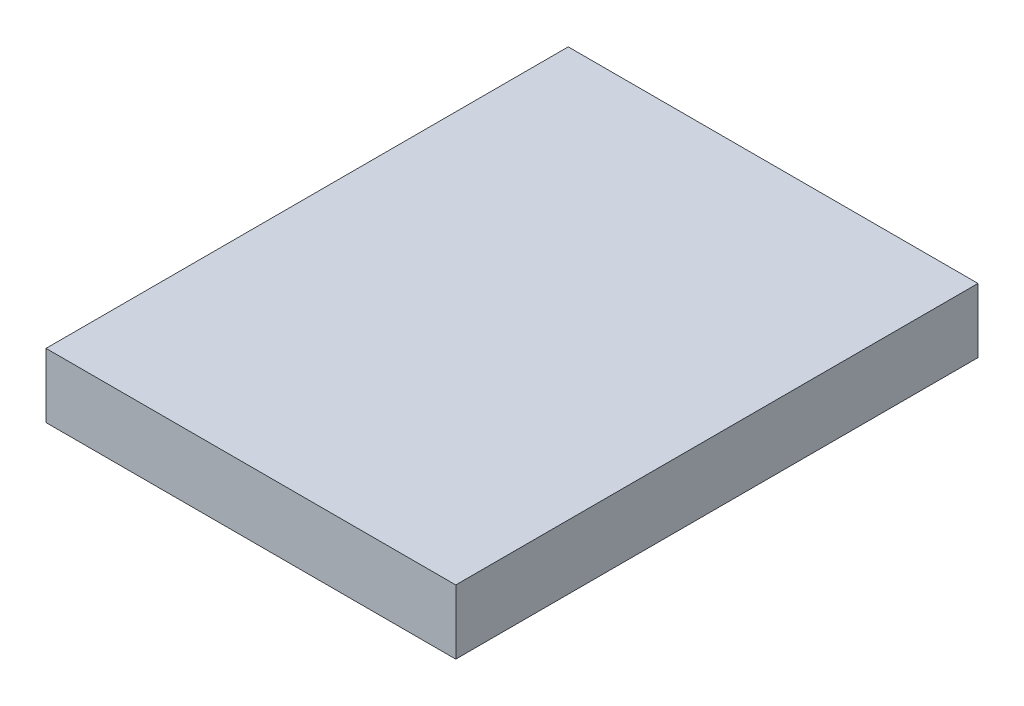
ISO-10303-21;
HEADER;
FILE_DESCRIPTION(('STEP AP214'),'2;1');
FILE_NAME('part.step','',(''),(''),'','','');
FILE_SCHEMA(('AUTOMOTIVE_DESIGN { 1 0 10303 214 1 1 1 1 }'));
ENDSEC;
DATA;
#1=APPLICATION_CONTEXT('core data for automotive mechanical design processes');
#2=APPLICATION_PROTOCOL_DEFINITION('international standard','automotive_design',2000,#1);
#3=PRODUCT_CONTEXT('',#1,'mechanical');
#4=PRODUCT('Part','Part','',(#3));
#5=PRODUCT_RELATED_PRODUCT_CATEGORY('part','',(#4));
#6=PRODUCT_DEFINITION_FORMATION('','',#4);
#7=PRODUCT_DEFINITION_CONTEXT('part definition',#1,'design');
#8=PRODUCT_DEFINITION('design','',#6,#7);
#9=PRODUCT_DEFINITION_SHAPE('','',#8);
#10=(LENGTH_UNIT() NAMED_UNIT(*) SI_UNIT(.MILLI.,.METRE.));
#11=(NAMED_UNIT(*) PLANE_ANGLE_UNIT() SI_UNIT($,.RADIAN.));
#12=(NAMED_UNIT(*) SI_UNIT($,.STERADIAN.) SOLID_ANGLE_UNIT());
#13=UNCERTAINTY_MEASURE_WITH_UNIT(LENGTH_MEASURE(1.E-05),#10,'distance_accuracy_value','');
#14=(GEOMETRIC_REPRESENTATION_CONTEXT(3) GLOBAL_UNCERTAINTY_ASSIGNED_CONTEXT((#13)) GLOBAL_UNIT_ASSIGNED_CONTEXT((#10,
#11,#12)) REPRESENTATION_CONTEXT('',''));
#15=CARTESIAN_POINT('',(0.,0.,0.));
#16=DIRECTION('',(0.,0.,1.));
#17=DIRECTION('',(1.,0.,0.));
#18=AXIS2_PLACEMENT_3D('',#15,#16,#17);
#19=CARTESIAN_POINT('',(25.5,8.,32.5));
#20=DIRECTION('',(-1.,0.,0.));
#21=DIRECTION('',(0.,0.,1.));
#22=AXIS2_PLACEMENT_3D('',#19,#20,#21);
#23=PLANE('',#22);
#24=DIRECTION('',(0.,0.,-1.));
#25=VECTOR('',#24,1.);
#26=CARTESIAN_POINT('',(25.5,0.,32.5));
#27=LINE('',#26,#25);
#28=CARTESIAN_POINT('',(25.5,0.,32.5));
#29=VERTEX_POINT('',#28);
#30=CARTESIAN_POINT('',(25.5,0.,-32.5));
#31=VERTEX_POINT('',#30);
#32=EDGE_CURVE('E98',#29,#31,#27,.T.);
#33=ORIENTED_EDGE('',*,*,#32,.T.);
#34=DIRECTION('',(0.,-1.,0.));
#35=VECTOR('',#34,1.);
#36=CARTESIAN_POINT('',(25.5,8.,-32.5));
#37=LINE('',#36,#35);
#38=CARTESIAN_POINT('',(25.5,8.,-32.5));
#39=VERTEX_POINT('',#38);
#40=EDGE_CURVE('E11',#39,#31,#37,.T.);
#41=ORIENTED_EDGE('',*,*,#40,.F.);
#42=DIRECTION('',(0.,0.,-1.));
#43=VECTOR('',#42,1.);
#44=CARTESIAN_POINT('',(25.5,8.,32.5));
#45=LINE('',#44,#43);
#46=CARTESIAN_POINT('',(25.5,8.,32.5));
#47=VERTEX_POINT('',#46);
#48=EDGE_CURVE('E86',#47,#39,#45,.T.);
#49=ORIENTED_EDGE('',*,*,#48,.F.);
#50=DIRECTION('',(0.,-1.,0.));
#51=VECTOR('',#50,1.);
#52=CARTESIAN_POINT('',(25.5,8.,32.5));
#53=LINE('',#52,#51);
#54=EDGE_CURVE('E94',#47,#29,#53,.T.);
#55=ORIENTED_EDGE('',*,*,#54,.T.);
#56=EDGE_LOOP('',(#33,#41,#49,#55));
#57=FACE_BOUND('',#56,.T.);
#58=ADVANCED_FACE('F35',(#57),#23,.F.);
#59=CARTESIAN_POINT('',(-25.5,8.,-32.5));
#60=DIRECTION('',(0.,0.,1.));
#61=DIRECTION('',(1.,0.,0.));
#62=AXIS2_PLACEMENT_3D('',#59,#60,#61);
#63=PLANE('',#62);
#64=DIRECTION('',(-1.,0.,0.));
#65=VECTOR('',#64,1.);
#66=CARTESIAN_POINT('',(-25.5,0.,-32.5));
#67=LINE('',#66,#65);
#68=CARTESIAN_POINT('',(-25.5,0.,-32.5));
#69=VERTEX_POINT('',#68);
#70=EDGE_CURVE('E90',#31,#69,#67,.T.);
#71=ORIENTED_EDGE('',*,*,#70,.T.);
#72=DIRECTION('',(0.,-1.,0.));
#73=VECTOR('',#72,1.);
#74=CARTESIAN_POINT('',(-25.5,8.,-32.5));
#75=LINE('',#74,#73);
#76=CARTESIAN_POINT('',(-25.5,8.,-32.5));
#77=VERTEX_POINT('',#76);
#78=EDGE_CURVE('E43',#77,#69,#75,.T.);
#79=ORIENTED_EDGE('',*,*,#78,.F.);
#80=DIRECTION('',(-1.,0.,0.));
#81=VECTOR('',#80,1.);
#82=CARTESIAN_POINT('',(-25.5,8.,-32.5));
#83=LINE('',#82,#81);
#84=EDGE_CURVE('E81',#39,#77,#83,.T.);
#85=ORIENTED_EDGE('',*,*,#84,.F.);
#86=ORIENTED_EDGE('',*,*,#40,.T.);
#87=EDGE_LOOP('',(#71,#79,#85,#86));
#88=FACE_BOUND('',#87,.T.);
#89=ADVANCED_FACE('F89',(#88),#63,.F.);
#90=CARTESIAN_POINT('',(-25.5,8.,32.5));
#91=DIRECTION('',(1.,0.,0.));
#92=DIRECTION('',(0.,0.,-1.));
#93=AXIS2_PLACEMENT_3D('',#90,#91,#92);
#94=PLANE('',#93);
#95=DIRECTION('',(0.,0.,1.));
#96=VECTOR('',#95,1.);
#97=CARTESIAN_POINT('',(-25.5,0.,32.5));
#98=LINE('',#97,#96);
#99=CARTESIAN_POINT('',(-25.5,0.,32.5));
#100=VERTEX_POINT('',#99);
#101=EDGE_CURVE('E68',#69,#100,#98,.T.);
#102=ORIENTED_EDGE('',*,*,#101,.T.);
#103=DIRECTION('',(0.,-1.,0.));
#104=VECTOR('',#103,1.);
#105=CARTESIAN_POINT('',(-25.5,8.,32.5));
#106=LINE('',#105,#104);
#107=CARTESIAN_POINT('',(-25.5,8.,32.5));
#108=VERTEX_POINT('',#107);
#109=EDGE_CURVE('E91',#108,#100,#106,.T.);
#110=ORIENTED_EDGE('',*,*,#109,.F.);
#111=DIRECTION('',(0.,0.,1.));
#112=VECTOR('',#111,1.);
#113=CARTESIAN_POINT('',(-25.5,8.,32.5));
#114=LINE('',#113,#112);
#115=EDGE_CURVE('E84',#77,#108,#114,.T.);
#116=ORIENTED_EDGE('',*,*,#115,.F.);
#117=ORIENTED_EDGE('',*,*,#78,.T.);
#118=EDGE_LOOP('',(#102,#110,#116,#117));
#119=FACE_BOUND('',#118,.T.);
#120=ADVANCED_FACE('F92',(#119),#94,.F.);
#121=CARTESIAN_POINT('',(-25.5,8.,32.5));
#122=DIRECTION('',(0.,0.,-1.));
#123=DIRECTION('',(-1.,0.,0.));
#124=AXIS2_PLACEMENT_3D('',#121,#122,#123);
#125=PLANE('',#124);
#126=DIRECTION('',(1.,0.,0.));
#127=VECTOR('',#126,1.);
#128=CARTESIAN_POINT('',(-25.5,0.,32.5));
#129=LINE('',#128,#127);
#130=EDGE_CURVE('E74',#100,#29,#129,.T.);
#131=ORIENTED_EDGE('',*,*,#130,.T.);
#132=ORIENTED_EDGE('',*,*,#54,.F.);
#133=DIRECTION('',(1.,0.,0.));
#134=VECTOR('',#133,1.);
#135=CARTESIAN_POINT('',(-25.5,8.,32.5));
#136=LINE('',#135,#134);
#137=EDGE_CURVE('E51',#108,#47,#136,.T.);
#138=ORIENTED_EDGE('',*,*,#137,.F.);
#139=ORIENTED_EDGE('',*,*,#109,.T.);
#140=EDGE_LOOP('',(#131,#132,#138,#139));
#141=FACE_BOUND('',#140,.T.);
#142=ADVANCED_FACE('F105',(#141),#125,.F.);
#143=CARTESIAN_POINT('',(0.,8.,0.));
#144=DIRECTION('',(0.,-1.,0.));
#145=DIRECTION('',(0.,0.,-1.));
#146=AXIS2_PLACEMENT_3D('',#143,#144,#145);
#147=PLANE('',#146);
#148=ORIENTED_EDGE('',*,*,#48,.T.);
#149=ORIENTED_EDGE('',*,*,#84,.T.);
#150=ORIENTED_EDGE('',*,*,#115,.T.);
#151=ORIENTED_EDGE('',*,*,#137,.T.);
#152=EDGE_LOOP('',(#148,#149,#150,#151));
#153=FACE_BOUND('',#152,.T.);
#154=ADVANCED_FACE('F82',(#153),#147,.F.);
#155=CARTESIAN_POINT('',(0.,0.,0.));
#156=DIRECTION('',(0.,-1.,0.));
#157=DIRECTION('',(0.,0.,-1.));
#158=AXIS2_PLACEMENT_3D('',#155,#156,#157);
#159=PLANE('',#158);
#160=ORIENTED_EDGE('',*,*,#32,.F.);
#161=ORIENTED_EDGE('',*,*,#130,.F.);
#162=ORIENTED_EDGE('',*,*,#101,.F.);
#163=ORIENTED_EDGE('',*,*,#70,.F.);
#164=EDGE_LOOP('',(#160,#161,#162,#163));
#165=FACE_BOUND('',#164,.T.);
#166=ADVANCED_FACE('F108',(#165),#159,.T.);
#167=CLOSED_SHELL('',(#58,#89,#120,#142,#154,#166));
#168=MANIFOLD_SOLID_BREP('B2',#167);
#169=ADVANCED_BREP_SHAPE_REPRESENTATION('',(#18,#168),#14);
#170=SHAPE_DEFINITION_REPRESENTATION(#9,#169);
ENDSEC;
END-ISO-10303-21;
